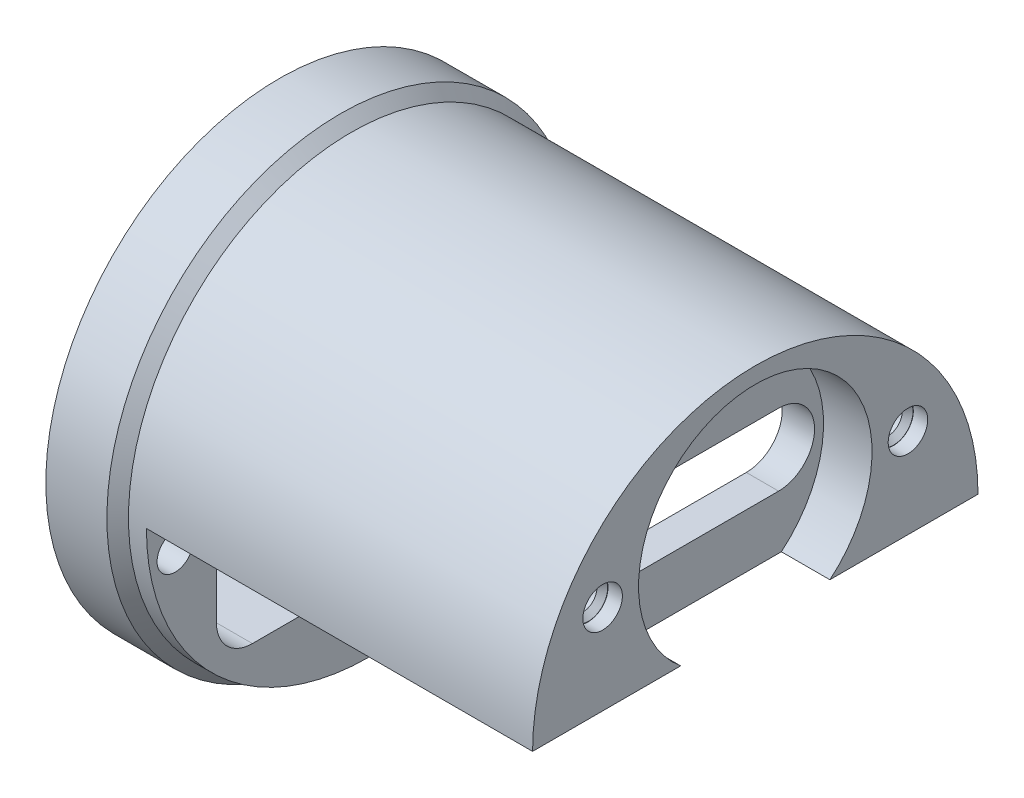
ISO-10303-21;
HEADER;
FILE_DESCRIPTION(('STEP AP214'),'2;1');
FILE_NAME('part.step','',(''),(''),'','','');
FILE_SCHEMA(('AUTOMOTIVE_DESIGN { 1 0 10303 214 1 1 1 1 }'));
ENDSEC;
DATA;
#1=APPLICATION_CONTEXT('core data for automotive mechanical design processes');
#2=APPLICATION_PROTOCOL_DEFINITION('international standard','automotive_design',2000,#1);
#3=PRODUCT_CONTEXT('',#1,'mechanical');
#4=PRODUCT('Part','Part','',(#3));
#5=PRODUCT_RELATED_PRODUCT_CATEGORY('part','',(#4));
#6=PRODUCT_DEFINITION_FORMATION('','',#4);
#7=PRODUCT_DEFINITION_CONTEXT('part definition',#1,'design');
#8=PRODUCT_DEFINITION('design','',#6,#7);
#9=PRODUCT_DEFINITION_SHAPE('','',#8);
#10=(LENGTH_UNIT() NAMED_UNIT(*) SI_UNIT(.MILLI.,.METRE.));
#11=(NAMED_UNIT(*) PLANE_ANGLE_UNIT() SI_UNIT($,.RADIAN.));
#12=(NAMED_UNIT(*) SI_UNIT($,.STERADIAN.) SOLID_ANGLE_UNIT());
#13=UNCERTAINTY_MEASURE_WITH_UNIT(LENGTH_MEASURE(1.E-05),#10,'distance_accuracy_value','');
#14=(GEOMETRIC_REPRESENTATION_CONTEXT(3) GLOBAL_UNCERTAINTY_ASSIGNED_CONTEXT((#13)) GLOBAL_UNIT_ASSIGNED_CONTEXT((#10,
#11,#12)) REPRESENTATION_CONTEXT('',''));
#15=CARTESIAN_POINT('',(0.,0.,0.));
#16=DIRECTION('',(0.,0.,1.));
#17=DIRECTION('',(1.,0.,0.));
#18=AXIS2_PLACEMENT_3D('',#15,#16,#17);
#19=CARTESIAN_POINT('',(-3.57708126390472,5.,8.5));
#20=DIRECTION('',(-1.,0.,0.));
#21=DIRECTION('',(0.,0.,1.));
#22=AXIS2_PLACEMENT_3D('',#19,#20,#21);
#23=PLANE('',#22);
#24=CARTESIAN_POINT('',(-3.57708126387024,5.,8.5));
#25=DIRECTION('',(1.,0.,0.));
#26=DIRECTION('',(0.,0.,-1.));
#27=AXIS2_PLACEMENT_3D('',#24,#25,#26);
#28=CIRCLE('',#27,1.08350000002338);
#29=CARTESIAN_POINT('',(-3.57708126387024,5.,7.41649999997662));
#30=VERTEX_POINT('',#29);
#31=EDGE_CURVE('E263',#30,#30,#28,.T.);
#32=ORIENTED_EDGE('',*,*,#31,.F.);
#33=EDGE_LOOP('',(#32));
#34=FACE_BOUND('',#33,.T.);
#35=CARTESIAN_POINT('',(-3.57708126390472,5.,8.5));
#36=DIRECTION('',(1.,0.,0.));
#37=DIRECTION('',(0.,0.,-1.));
#38=AXIS2_PLACEMENT_3D('',#35,#36,#37);
#39=CIRCLE('',#38,1.1);
#40=CARTESIAN_POINT('',(-3.57708126390472,5.,7.4));
#41=VERTEX_POINT('',#40);
#42=EDGE_CURVE('E257',#41,#41,#39,.T.);
#43=ORIENTED_EDGE('',*,*,#42,.T.);
#44=EDGE_LOOP('',(#43));
#45=FACE_BOUND('',#44,.T.);
#46=ADVANCED_FACE('F16',(#34,#45),#23,.F.);
#47=CARTESIAN_POINT('',(-3.57708126390472,5.,-8.5));
#48=DIRECTION('',(-1.,0.,0.));
#49=DIRECTION('',(0.,0.,1.));
#50=AXIS2_PLACEMENT_3D('',#47,#48,#49);
#51=PLANE('',#50);
#52=CARTESIAN_POINT('',(-3.57708126387024,5.,-8.5));
#53=DIRECTION('',(1.,0.,0.));
#54=DIRECTION('',(0.,1.,0.));
#55=AXIS2_PLACEMENT_3D('',#52,#53,#54);
#56=CIRCLE('',#55,1.08350000001928);
#57=CARTESIAN_POINT('',(-3.57708126387024,6.08350000001928,-8.5));
#58=VERTEX_POINT('',#57);
#59=EDGE_CURVE('E260',#58,#58,#56,.T.);
#60=ORIENTED_EDGE('',*,*,#59,.F.);
#61=EDGE_LOOP('',(#60));
#62=FACE_BOUND('',#61,.T.);
#63=CARTESIAN_POINT('',(-3.57708126390472,5.,-8.5));
#64=DIRECTION('',(1.,0.,0.));
#65=DIRECTION('',(0.,0.,-1.));
#66=AXIS2_PLACEMENT_3D('',#63,#64,#65);
#67=CIRCLE('',#66,1.1);
#68=CARTESIAN_POINT('',(-3.57708126390472,5.,-9.6));
#69=VERTEX_POINT('',#68);
#70=EDGE_CURVE('E180',#69,#69,#67,.T.);
#71=ORIENTED_EDGE('',*,*,#70,.T.);
#72=EDGE_LOOP('',(#71));
#73=FACE_BOUND('',#72,.T.);
#74=ADVANCED_FACE('F567',(#62,#73),#51,.F.);
#75=CARTESIAN_POINT('',(-27.5770812639047,0.,0.));
#76=DIRECTION('',(1.,0.,0.));
#77=DIRECTION('',(0.,0.,-1.));
#78=AXIS2_PLACEMENT_3D('',#75,#76,#77);
#79=CYLINDRICAL_SURFACE('',#78,13.);
#80=CARTESIAN_POINT('',(-25.8770812639047,0.,0.));
#81=DIRECTION('',(-1.,0.,0.));
#82=DIRECTION('',(0.,1.,0.));
#83=AXIS2_PLACEMENT_3D('',#80,#81,#82);
#84=CIRCLE('',#83,13.);
#85=CARTESIAN_POINT('',(-25.8770812639047,13.,0.));
#86=VERTEX_POINT('',#85);
#87=EDGE_CURVE('E177',#86,#86,#84,.F.);
#88=ORIENTED_EDGE('',*,*,#87,.F.);
#89=EDGE_LOOP('',(#88));
#90=FACE_BOUND('',#89,.T.);
#91=CARTESIAN_POINT('',(-29.2770812639047,0.,0.));
#92=DIRECTION('',(1.,0.,0.));
#93=DIRECTION('',(0.,0.,-1.));
#94=AXIS2_PLACEMENT_3D('',#91,#92,#93);
#95=CIRCLE('',#94,13.);
#96=CARTESIAN_POINT('',(-29.2770812639047,0.,-13.));
#97=VERTEX_POINT('',#96);
#98=EDGE_CURVE('E266',#97,#97,#95,.F.);
#99=ORIENTED_EDGE('',*,*,#98,.F.);
#100=EDGE_LOOP('',(#99));
#101=FACE_BOUND('',#100,.T.);
#102=ADVANCED_FACE('F279',(#90,#101),#79,.T.);
#103=CARTESIAN_POINT('',(-29.2770812638992,-1.9,-10.8));
#104=DIRECTION('',(-1.,0.,0.));
#105=DIRECTION('',(0.,0.,1.));
#106=AXIS2_PLACEMENT_3D('',#103,#104,#105);
#107=CONICAL_SURFACE('',#106,1.35000000004156,0.785398163397448);
#108=CARTESIAN_POINT('',(-29.2770812638992,-1.9,-10.8));
#109=DIRECTION('',(-1.,0.,0.));
#110=DIRECTION('',(0.,0.,1.));
#111=AXIS2_PLACEMENT_3D('',#108,#109,#110);
#112=CIRCLE('',#111,1.35000000004156);
#113=CARTESIAN_POINT('',(-29.2770812638992,-1.9,-9.44999999995844));
#114=VERTEX_POINT('',#113);
#115=EDGE_CURVE('E19',#114,#114,#112,.F.);
#116=ORIENTED_EDGE('',*,*,#115,.F.);
#117=EDGE_LOOP('',(#116));
#118=FACE_BOUND('',#117,.T.);
#119=CARTESIAN_POINT('',(-28.9335812639047,-1.9,-10.8));
#120=DIRECTION('',(-1.,0.,0.));
#121=DIRECTION('',(0.,0.,1.));
#122=AXIS2_PLACEMENT_3D('',#119,#120,#121);
#123=CIRCLE('',#122,1.0065);
#124=CARTESIAN_POINT('',(-28.9335812639047,-1.9,-9.7935));
#125=VERTEX_POINT('',#124);
#126=EDGE_CURVE('E174',#125,#125,#123,.F.);
#127=ORIENTED_EDGE('',*,*,#126,.T.);
#128=EDGE_LOOP('',(#127));
#129=FACE_BOUND('',#128,.T.);
#130=ADVANCED_FACE('F275',(#118,#129),#107,.F.);
#131=CARTESIAN_POINT('',(-29.2770812638992,-1.9,10.8));
#132=DIRECTION('',(-1.,0.,0.));
#133=DIRECTION('',(0.,0.,1.));
#134=AXIS2_PLACEMENT_3D('',#131,#132,#133);
#135=CONICAL_SURFACE('',#134,1.35000000007649,0.785398163397448);
#136=CARTESIAN_POINT('',(-29.2770812638992,-1.9,10.8));
#137=DIRECTION('',(-1.,0.,0.));
#138=DIRECTION('',(0.,0.,1.));
#139=AXIS2_PLACEMENT_3D('',#136,#137,#138);
#140=CIRCLE('',#139,1.35000000007649);
#141=CARTESIAN_POINT('',(-29.2770812638992,-1.9,12.1500000000765));
#142=VERTEX_POINT('',#141);
#143=EDGE_CURVE('E268',#142,#142,#140,.F.);
#144=ORIENTED_EDGE('',*,*,#143,.F.);
#145=EDGE_LOOP('',(#144));
#146=FACE_BOUND('',#145,.T.);
#147=CARTESIAN_POINT('',(-28.9335812639047,-1.9,10.8));
#148=DIRECTION('',(-1.,0.,0.));
#149=DIRECTION('',(0.,0.,1.));
#150=AXIS2_PLACEMENT_3D('',#147,#148,#149);
#151=CIRCLE('',#150,1.0065);
#152=CARTESIAN_POINT('',(-28.9335812639047,-1.9,11.8065));
#153=VERTEX_POINT('',#152);
#154=EDGE_CURVE('E154',#153,#153,#151,.F.);
#155=ORIENTED_EDGE('',*,*,#154,.T.);
#156=EDGE_LOOP('',(#155));
#157=FACE_BOUND('',#156,.T.);
#158=ADVANCED_FACE('F278',(#146,#157),#135,.F.);
#159=CARTESIAN_POINT('',(-29.2770812639047,6.5,0.));
#160=DIRECTION('',(-1.,0.,0.));
#161=DIRECTION('',(0.,0.,1.));
#162=AXIS2_PLACEMENT_3D('',#159,#160,#161);
#163=PLANE('',#162);
#164=ORIENTED_EDGE('',*,*,#98,.T.);
#165=EDGE_LOOP('',(#164));
#166=FACE_BOUND('',#165,.T.);
#167=DIRECTION('',(0.,-1.,0.));
#168=VECTOR('',#167,1.);
#169=CARTESIAN_POINT('',(-29.2770812639047,-6.5,8.5));
#170=LINE('',#169,#168);
#171=CARTESIAN_POINT('',(-29.2770812639047,6.5,8.5));
#172=VERTEX_POINT('',#171);
#173=CARTESIAN_POINT('',(-29.2770812639047,-6.5,8.5));
#174=VERTEX_POINT('',#173);
#175=EDGE_CURVE('E417',#172,#174,#170,.T.);
#176=ORIENTED_EDGE('',*,*,#175,.T.);
#177=CARTESIAN_POINT('',(-29.2770812639047,-6.5,6.5));
#178=DIRECTION('',(1.,0.,0.));
#179=DIRECTION('',(0.,0.,-1.));
#180=AXIS2_PLACEMENT_3D('',#177,#178,#179);
#181=CIRCLE('',#180,2.);
#182=CARTESIAN_POINT('',(-29.2770812639047,-8.5,6.5));
#183=VERTEX_POINT('',#182);
#184=EDGE_CURVE('E161',#174,#183,#181,.T.);
#185=ORIENTED_EDGE('',*,*,#184,.T.);
#186=DIRECTION('',(0.,0.,-1.));
#187=VECTOR('',#186,1.);
#188=CARTESIAN_POINT('',(-29.2770812639047,-8.5,-6.5));
#189=LINE('',#188,#187);
#190=CARTESIAN_POINT('',(-29.2770812639047,-8.5,-6.5));
#191=VERTEX_POINT('',#190);
#192=EDGE_CURVE('E153',#183,#191,#189,.T.);
#193=ORIENTED_EDGE('',*,*,#192,.T.);
#194=CARTESIAN_POINT('',(-29.2770812639047,-6.5,-6.5));
#195=DIRECTION('',(1.,0.,0.));
#196=DIRECTION('',(0.,0.,-1.));
#197=AXIS2_PLACEMENT_3D('',#194,#195,#196);
#198=CIRCLE('',#197,2.);
#199=CARTESIAN_POINT('',(-29.2770812639047,-6.5,-8.5));
#200=VERTEX_POINT('',#199);
#201=EDGE_CURVE('E143',#191,#200,#198,.T.);
#202=ORIENTED_EDGE('',*,*,#201,.T.);
#203=DIRECTION('',(0.,1.,0.));
#204=VECTOR('',#203,1.);
#205=CARTESIAN_POINT('',(-29.2770812639047,6.5,-8.5));
#206=LINE('',#205,#204);
#207=CARTESIAN_POINT('',(-29.2770812639047,6.5,-8.5));
#208=VERTEX_POINT('',#207);
#209=EDGE_CURVE('E170',#200,#208,#206,.T.);
#210=ORIENTED_EDGE('',*,*,#209,.T.);
#211=CARTESIAN_POINT('',(-29.2770812639047,6.5,-6.5));
#212=DIRECTION('',(1.,0.,0.));
#213=DIRECTION('',(0.,0.,-1.));
#214=AXIS2_PLACEMENT_3D('',#211,#212,#213);
#215=CIRCLE('',#214,2.);
#216=CARTESIAN_POINT('',(-29.2770812639047,8.5,-6.5));
#217=VERTEX_POINT('',#216);
#218=EDGE_CURVE('E249',#208,#217,#215,.T.);
#219=ORIENTED_EDGE('',*,*,#218,.T.);
#220=DIRECTION('',(0.,0.,1.));
#221=VECTOR('',#220,1.);
#222=CARTESIAN_POINT('',(-29.2770812639047,8.5,6.5));
#223=LINE('',#222,#221);
#224=CARTESIAN_POINT('',(-29.2770812639047,8.5,6.5));
#225=VERTEX_POINT('',#224);
#226=EDGE_CURVE('E423',#217,#225,#223,.T.);
#227=ORIENTED_EDGE('',*,*,#226,.T.);
#228=CARTESIAN_POINT('',(-29.2770812639047,6.5,6.5));
#229=DIRECTION('',(1.,0.,0.));
#230=DIRECTION('',(0.,0.,-1.));
#231=AXIS2_PLACEMENT_3D('',#228,#229,#230);
#232=CIRCLE('',#231,2.);
#233=EDGE_CURVE('E245',#225,#172,#232,.T.);
#234=ORIENTED_EDGE('',*,*,#233,.T.);
#235=EDGE_LOOP('',(#176,#185,#193,#202,#210,#219,#227,#234));
#236=FACE_BOUND('',#235,.T.);
#237=ORIENTED_EDGE('',*,*,#143,.T.);
#238=EDGE_LOOP('',(#237));
#239=FACE_BOUND('',#238,.T.);
#240=ORIENTED_EDGE('',*,*,#115,.T.);
#241=EDGE_LOOP('',(#240));
#242=FACE_BOUND('',#241,.T.);
#243=ADVANCED_FACE('F165',(#166,#236,#239,#242),#163,.T.);
#244=CARTESIAN_POINT('',(-3.87708126396547,5.,8.5));
#245=DIRECTION('',(1.,0.,0.));
#246=DIRECTION('',(0.,0.,-1.));
#247=AXIS2_PLACEMENT_3D('',#244,#245,#246);
#248=CONICAL_SURFACE('',#247,0.783499999928154,0.785398163397448);
#249=CARTESIAN_POINT('',(-3.87708126390472,5.,8.5));
#250=DIRECTION('',(1.,0.,0.));
#251=DIRECTION('',(0.,0.,-1.));
#252=AXIS2_PLACEMENT_3D('',#249,#250,#251);
#253=CIRCLE('',#252,0.7835);
#254=CARTESIAN_POINT('',(-3.87708126390472,5.,7.7165));
#255=VERTEX_POINT('',#254);
#256=EDGE_CURVE('E436',#255,#255,#253,.F.);
#257=ORIENTED_EDGE('',*,*,#256,.T.);
#258=EDGE_LOOP('',(#257));
#259=FACE_BOUND('',#258,.T.);
#260=ORIENTED_EDGE('',*,*,#31,.T.);
#261=EDGE_LOOP('',(#260));
#262=FACE_BOUND('',#261,.T.);
#263=ADVANCED_FACE('F555',(#259,#262),#248,.F.);
#264=CARTESIAN_POINT('',(-3.87708126402231,5.,-8.5));
#265=DIRECTION('',(1.,0.,0.));
#266=DIRECTION('',(0.,1.,0.));
#267=AXIS2_PLACEMENT_3D('',#264,#265,#266);
#268=CONICAL_SURFACE('',#267,0.783499999867217,0.785398163397448);
#269=CARTESIAN_POINT('',(-3.87708126390472,5.,-8.5));
#270=DIRECTION('',(1.,0.,0.));
#271=DIRECTION('',(0.,0.,-1.));
#272=AXIS2_PLACEMENT_3D('',#269,#270,#271);
#273=CIRCLE('',#272,0.7835);
#274=CARTESIAN_POINT('',(-3.87708126390472,5.,-9.2835));
#275=VERTEX_POINT('',#274);
#276=EDGE_CURVE('E413',#275,#275,#273,.F.);
#277=ORIENTED_EDGE('',*,*,#276,.T.);
#278=EDGE_LOOP('',(#277));
#279=FACE_BOUND('',#278,.T.);
#280=ORIENTED_EDGE('',*,*,#59,.T.);
#281=EDGE_LOOP('',(#280));
#282=FACE_BOUND('',#281,.T.);
#283=ADVANCED_FACE('F551',(#279,#282),#268,.F.);
#284=CARTESIAN_POINT('',(-3.17708126390472,5.,8.5));
#285=DIRECTION('',(1.,0.,0.));
#286=DIRECTION('',(0.,0.,-1.));
#287=AXIS2_PLACEMENT_3D('',#284,#285,#286);
#288=CYLINDRICAL_SURFACE('',#287,1.1);
#289=CARTESIAN_POINT('',(-2.77708126390471,5.,8.5));
#290=DIRECTION('',(1.,0.,0.));
#291=DIRECTION('',(0.,0.,-1.));
#292=AXIS2_PLACEMENT_3D('',#289,#290,#291);
#293=CIRCLE('',#292,1.1);
#294=CARTESIAN_POINT('',(-2.77708126390471,5.,7.4));
#295=VERTEX_POINT('',#294);
#296=EDGE_CURVE('E232',#295,#295,#293,.F.);
#297=ORIENTED_EDGE('',*,*,#296,.F.);
#298=EDGE_LOOP('',(#297));
#299=FACE_BOUND('',#298,.T.);
#300=ORIENTED_EDGE('',*,*,#42,.F.);
#301=EDGE_LOOP('',(#300));
#302=FACE_BOUND('',#301,.T.);
#303=ADVANCED_FACE('F547',(#299,#302),#288,.F.);
#304=CARTESIAN_POINT('',(-3.17708126390472,5.,-8.5));
#305=DIRECTION('',(1.,0.,0.));
#306=DIRECTION('',(0.,0.,-1.));
#307=AXIS2_PLACEMENT_3D('',#304,#305,#306);
#308=CYLINDRICAL_SURFACE('',#307,1.1);
#309=CARTESIAN_POINT('',(-2.77708126390471,5.,-8.5));
#310=DIRECTION('',(1.,0.,0.));
#311=DIRECTION('',(0.,0.,-1.));
#312=AXIS2_PLACEMENT_3D('',#309,#310,#311);
#313=CIRCLE('',#312,1.1);
#314=CARTESIAN_POINT('',(-2.77708126390471,5.,-9.6));
#315=VERTEX_POINT('',#314);
#316=EDGE_CURVE('E229',#315,#315,#313,.F.);
#317=ORIENTED_EDGE('',*,*,#316,.F.);
#318=EDGE_LOOP('',(#317));
#319=FACE_BOUND('',#318,.T.);
#320=ORIENTED_EDGE('',*,*,#70,.F.);
#321=EDGE_LOOP('',(#320));
#322=FACE_BOUND('',#321,.T.);
#323=ADVANCED_FACE('F543',(#319,#322),#308,.F.);
#324=CARTESIAN_POINT('',(-25.8770812639047,0.,0.));
#325=DIRECTION('',(-1.,0.,0.));
#326=DIRECTION('',(0.,0.,1.));
#327=AXIS2_PLACEMENT_3D('',#324,#325,#326);
#328=CONICAL_SURFACE('',#327,13.,0.785398163397445);
#329=CARTESIAN_POINT('',(-25.2770812639047,0.,0.));
#330=DIRECTION('',(1.,0.,0.));
#331=DIRECTION('',(0.,0.,-1.));
#332=AXIS2_PLACEMENT_3D('',#329,#330,#331);
#333=CIRCLE('',#332,12.4);
#334=CARTESIAN_POINT('',(-25.2770812639047,0.,-12.4));
#335=VERTEX_POINT('',#334);
#336=EDGE_CURVE('E224',#335,#335,#333,.T.);
#337=ORIENTED_EDGE('',*,*,#336,.F.);
#338=EDGE_LOOP('',(#337));
#339=FACE_BOUND('',#338,.T.);
#340=ORIENTED_EDGE('',*,*,#87,.T.);
#341=EDGE_LOOP('',(#340));
#342=FACE_BOUND('',#341,.T.);
#343=ADVANCED_FACE('F287',(#339,#342),#328,.T.);
#344=CARTESIAN_POINT('',(-20.2770812639047,-1.9,-10.8));
#345=DIRECTION('',(-1.,0.,0.));
#346=DIRECTION('',(0.,0.,1.));
#347=AXIS2_PLACEMENT_3D('',#344,#345,#346);
#348=CYLINDRICAL_SURFACE('',#347,1.0065);
#349=ORIENTED_EDGE('',*,*,#126,.F.);
#350=EDGE_LOOP('',(#349));
#351=FACE_BOUND('',#350,.T.);
#352=CARTESIAN_POINT('',(-24.2770812639047,-1.9,-10.8));
#353=DIRECTION('',(-1.,0.,0.));
#354=DIRECTION('',(0.,0.,1.));
#355=AXIS2_PLACEMENT_3D('',#352,#353,#354);
#356=CIRCLE('',#355,1.0065);
#357=CARTESIAN_POINT('',(-24.2770812639047,-1.9,-9.7935));
#358=VERTEX_POINT('',#357);
#359=EDGE_CURVE('E221',#358,#358,#356,.T.);
#360=ORIENTED_EDGE('',*,*,#359,.F.);
#361=EDGE_LOOP('',(#360));
#362=FACE_BOUND('',#361,.T.);
#363=ADVANCED_FACE('F283',(#351,#362),#348,.F.);
#364=CARTESIAN_POINT('',(-20.2770812639047,-1.9,10.8));
#365=DIRECTION('',(-1.,0.,0.));
#366=DIRECTION('',(0.,0.,1.));
#367=AXIS2_PLACEMENT_3D('',#364,#365,#366);
#368=CYLINDRICAL_SURFACE('',#367,1.0065);
#369=ORIENTED_EDGE('',*,*,#154,.F.);
#370=EDGE_LOOP('',(#369));
#371=FACE_BOUND('',#370,.T.);
#372=CARTESIAN_POINT('',(-24.2770812639047,-1.9,10.8));
#373=DIRECTION('',(-1.,0.,0.));
#374=DIRECTION('',(0.,0.,1.));
#375=AXIS2_PLACEMENT_3D('',#372,#373,#374);
#376=CIRCLE('',#375,1.0065);
#377=CARTESIAN_POINT('',(-24.2770812639047,-1.9,11.8065));
#378=VERTEX_POINT('',#377);
#379=EDGE_CURVE('E218',#378,#378,#376,.T.);
#380=ORIENTED_EDGE('',*,*,#379,.F.);
#381=EDGE_LOOP('',(#380));
#382=FACE_BOUND('',#381,.T.);
#383=ADVANCED_FACE('F286',(#371,#382),#368,.F.);
#384=CARTESIAN_POINT('',(-29.2770812639047,-6.5,-6.5));
#385=DIRECTION('',(1.,0.,0.));
#386=DIRECTION('',(0.,0.,-1.));
#387=AXIS2_PLACEMENT_3D('',#384,#385,#386);
#388=CYLINDRICAL_SURFACE('',#387,2.);
#389=DIRECTION('',(1.,0.,0.));
#390=VECTOR('',#389,1.);
#391=CARTESIAN_POINT('',(-29.2770812639047,-6.5,-8.49999999999999));
#392=LINE('',#391,#390);
#393=CARTESIAN_POINT('',(-24.2770812639047,-6.5,-8.5));
#394=VERTEX_POINT('',#393);
#395=EDGE_CURVE('E149',#394,#200,#392,.F.);
#396=ORIENTED_EDGE('',*,*,#395,.T.);
#397=ORIENTED_EDGE('',*,*,#201,.F.);
#398=DIRECTION('',(1.,0.,0.));
#399=VECTOR('',#398,1.);
#400=CARTESIAN_POINT('',(-29.2770812639047,-8.5,-6.5));
#401=LINE('',#400,#399);
#402=CARTESIAN_POINT('',(-24.2770812639047,-8.5,-6.5));
#403=VERTEX_POINT('',#402);
#404=EDGE_CURVE('E147',#191,#403,#401,.T.);
#405=ORIENTED_EDGE('',*,*,#404,.T.);
#406=CARTESIAN_POINT('',(-24.2770812639047,-6.5,-6.5));
#407=DIRECTION('',(1.,0.,0.));
#408=DIRECTION('',(0.,0.,-1.));
#409=AXIS2_PLACEMENT_3D('',#406,#407,#408);
#410=CIRCLE('',#409,2.);
#411=EDGE_CURVE('E212',#394,#403,#410,.F.);
#412=ORIENTED_EDGE('',*,*,#411,.F.);
#413=EDGE_LOOP('',(#396,#397,#405,#412));
#414=FACE_BOUND('',#413,.T.);
#415=ADVANCED_FACE('F145',(#414),#388,.F.);
#416=CARTESIAN_POINT('',(-29.2770812639047,-8.5,-6.5));
#417=DIRECTION('',(0.,-1.,0.));
#418=DIRECTION('',(0.,0.,-1.));
#419=AXIS2_PLACEMENT_3D('',#416,#417,#418);
#420=PLANE('',#419);
#421=ORIENTED_EDGE('',*,*,#404,.F.);
#422=ORIENTED_EDGE('',*,*,#192,.F.);
#423=DIRECTION('',(1.,0.,0.));
#424=VECTOR('',#423,1.);
#425=CARTESIAN_POINT('',(-29.2770812639047,-8.5,6.5));
#426=LINE('',#425,#424);
#427=CARTESIAN_POINT('',(-24.2770812639047,-8.5,6.5));
#428=VERTEX_POINT('',#427);
#429=EDGE_CURVE('E253',#183,#428,#426,.T.);
#430=ORIENTED_EDGE('',*,*,#429,.T.);
#431=DIRECTION('',(0.,0.,-1.));
#432=VECTOR('',#431,1.);
#433=CARTESIAN_POINT('',(-24.2770812639047,-8.5,0.));
#434=LINE('',#433,#432);
#435=EDGE_CURVE('E160',#403,#428,#434,.F.);
#436=ORIENTED_EDGE('',*,*,#435,.F.);
#437=EDGE_LOOP('',(#421,#422,#430,#436));
#438=FACE_BOUND('',#437,.T.);
#439=ADVANCED_FACE('F157',(#438),#420,.F.);
#440=CARTESIAN_POINT('',(-29.2770812639047,-6.5,6.5));
#441=DIRECTION('',(1.,0.,0.));
#442=DIRECTION('',(0.,0.,-1.));
#443=AXIS2_PLACEMENT_3D('',#440,#441,#442);
#444=CYLINDRICAL_SURFACE('',#443,2.);
#445=ORIENTED_EDGE('',*,*,#429,.F.);
#446=ORIENTED_EDGE('',*,*,#184,.F.);
#447=DIRECTION('',(1.,0.,0.));
#448=VECTOR('',#447,1.);
#449=CARTESIAN_POINT('',(-29.2770812639047,-6.5,8.5));
#450=LINE('',#449,#448);
#451=CARTESIAN_POINT('',(-24.2770812639047,-6.5,8.5));
#452=VERTEX_POINT('',#451);
#453=EDGE_CURVE('E434',#174,#452,#450,.T.);
#454=ORIENTED_EDGE('',*,*,#453,.T.);
#455=CARTESIAN_POINT('',(-24.2770812639047,-6.5,6.5));
#456=DIRECTION('',(1.,0.,0.));
#457=DIRECTION('',(0.,0.,-1.));
#458=AXIS2_PLACEMENT_3D('',#455,#456,#457);
#459=CIRCLE('',#458,2.);
#460=EDGE_CURVE('E209',#428,#452,#459,.F.);
#461=ORIENTED_EDGE('',*,*,#460,.F.);
#462=EDGE_LOOP('',(#445,#446,#454,#461));
#463=FACE_BOUND('',#462,.T.);
#464=ADVANCED_FACE('F530',(#463),#444,.F.);
#465=CARTESIAN_POINT('',(-29.2770812639047,6.5,-8.5));
#466=DIRECTION('',(0.,0.,-1.));
#467=DIRECTION('',(0.,1.,0.));
#468=AXIS2_PLACEMENT_3D('',#465,#466,#467);
#469=PLANE('',#468);
#470=DIRECTION('',(1.,0.,0.));
#471=VECTOR('',#470,1.);
#472=CARTESIAN_POINT('',(-29.2770812639047,0.,-8.5));
#473=LINE('',#472,#471);
#474=CARTESIAN_POINT('',(-23.2770812639047,0.,-8.5));
#475=VERTEX_POINT('',#474);
#476=CARTESIAN_POINT('',(-24.2770812639047,0.,-8.5));
#477=VERTEX_POINT('',#476);
#478=EDGE_CURVE('E428',#475,#477,#473,.F.);
#479=ORIENTED_EDGE('',*,*,#478,.F.);
#480=DIRECTION('',(0.,1.,0.));
#481=VECTOR('',#480,1.);
#482=CARTESIAN_POINT('',(-23.2770812639047,0.,-8.5));
#483=LINE('',#482,#481);
#484=CARTESIAN_POINT('',(-23.2770812639047,6.5,-8.5));
#485=VERTEX_POINT('',#484);
#486=EDGE_CURVE('E208',#475,#485,#483,.T.);
#487=ORIENTED_EDGE('',*,*,#486,.T.);
#488=DIRECTION('',(1.,0.,0.));
#489=VECTOR('',#488,1.);
#490=CARTESIAN_POINT('',(-29.2770812639047,6.5,-8.5));
#491=LINE('',#490,#489);
#492=EDGE_CURVE('E252',#485,#208,#491,.F.);
#493=ORIENTED_EDGE('',*,*,#492,.T.);
#494=ORIENTED_EDGE('',*,*,#209,.F.);
#495=ORIENTED_EDGE('',*,*,#395,.F.);
#496=DIRECTION('',(0.,1.,0.));
#497=VECTOR('',#496,1.);
#498=CARTESIAN_POINT('',(-24.2770812639047,-4.55921800622678,-8.5));
#499=LINE('',#498,#497);
#500=EDGE_CURVE('E214',#477,#394,#499,.F.);
#501=ORIENTED_EDGE('',*,*,#500,.F.);
#502=EDGE_LOOP('',(#479,#487,#493,#494,#495,#501));
#503=FACE_BOUND('',#502,.T.);
#504=ADVANCED_FACE('F460',(#503),#469,.F.);
#505=CARTESIAN_POINT('',(-29.2770812639047,6.5,-6.5));
#506=DIRECTION('',(1.,0.,0.));
#507=DIRECTION('',(0.,0.,-1.));
#508=AXIS2_PLACEMENT_3D('',#505,#506,#507);
#509=CYLINDRICAL_SURFACE('',#508,2.);
#510=DIRECTION('',(1.,0.,0.));
#511=VECTOR('',#510,1.);
#512=CARTESIAN_POINT('',(-29.2770812639047,8.5,-6.5));
#513=LINE('',#512,#511);
#514=CARTESIAN_POINT('',(-23.2770812639047,8.5,-6.5));
#515=VERTEX_POINT('',#514);
#516=EDGE_CURVE('E251',#515,#217,#513,.F.);
#517=ORIENTED_EDGE('',*,*,#516,.T.);
#518=ORIENTED_EDGE('',*,*,#218,.F.);
#519=ORIENTED_EDGE('',*,*,#492,.F.);
#520=CARTESIAN_POINT('',(-23.2770812639047,6.5,-6.5));
#521=DIRECTION('',(1.,0.,0.));
#522=DIRECTION('',(0.,0.,-1.));
#523=AXIS2_PLACEMENT_3D('',#520,#521,#522);
#524=CIRCLE('',#523,2.);
#525=EDGE_CURVE('E205',#485,#515,#524,.T.);
#526=ORIENTED_EDGE('',*,*,#525,.T.);
#527=EDGE_LOOP('',(#517,#518,#519,#526));
#528=FACE_BOUND('',#527,.T.);
#529=ADVANCED_FACE('F457',(#528),#509,.F.);
#530=CARTESIAN_POINT('',(-29.2770812639047,8.5,6.5));
#531=DIRECTION('',(0.,1.,0.));
#532=DIRECTION('',(0.,0.,1.));
#533=AXIS2_PLACEMENT_3D('',#530,#531,#532);
#534=PLANE('',#533);
#535=DIRECTION('',(1.,0.,0.));
#536=VECTOR('',#535,1.);
#537=CARTESIAN_POINT('',(-29.2770812639047,8.5,6.5));
#538=LINE('',#537,#536);
#539=CARTESIAN_POINT('',(-23.2770812639047,8.5,6.5));
#540=VERTEX_POINT('',#539);
#541=EDGE_CURVE('E248',#540,#225,#538,.F.);
#542=ORIENTED_EDGE('',*,*,#541,.T.);
#543=ORIENTED_EDGE('',*,*,#226,.F.);
#544=ORIENTED_EDGE('',*,*,#516,.F.);
#545=DIRECTION('',(0.,0.,1.));
#546=VECTOR('',#545,1.);
#547=CARTESIAN_POINT('',(-23.2770812639047,8.5,0.));
#548=LINE('',#547,#546);
#549=EDGE_CURVE('E204',#515,#540,#548,.T.);
#550=ORIENTED_EDGE('',*,*,#549,.T.);
#551=EDGE_LOOP('',(#542,#543,#544,#550));
#552=FACE_BOUND('',#551,.T.);
#553=ADVANCED_FACE('F451',(#552),#534,.F.);
#554=CARTESIAN_POINT('',(-29.2770812639047,6.5,6.5));
#555=DIRECTION('',(1.,0.,0.));
#556=DIRECTION('',(0.,0.,-1.));
#557=AXIS2_PLACEMENT_3D('',#554,#555,#556);
#558=CYLINDRICAL_SURFACE('',#557,2.);
#559=DIRECTION('',(1.,0.,0.));
#560=VECTOR('',#559,1.);
#561=CARTESIAN_POINT('',(-29.2770812639047,6.5,8.5));
#562=LINE('',#561,#560);
#563=CARTESIAN_POINT('',(-23.2770812639047,6.5,8.5));
#564=VERTEX_POINT('',#563);
#565=EDGE_CURVE('E414',#564,#172,#562,.F.);
#566=ORIENTED_EDGE('',*,*,#565,.T.);
#567=ORIENTED_EDGE('',*,*,#233,.F.);
#568=ORIENTED_EDGE('',*,*,#541,.F.);
#569=CARTESIAN_POINT('',(-23.2770812639047,6.5,6.5));
#570=DIRECTION('',(1.,0.,0.));
#571=DIRECTION('',(0.,0.,-1.));
#572=AXIS2_PLACEMENT_3D('',#569,#570,#571);
#573=CIRCLE('',#572,2.);
#574=EDGE_CURVE('E201',#540,#564,#573,.T.);
#575=ORIENTED_EDGE('',*,*,#574,.T.);
#576=EDGE_LOOP('',(#566,#567,#568,#575));
#577=FACE_BOUND('',#576,.T.);
#578=ADVANCED_FACE('F449',(#577),#558,.F.);
#579=CARTESIAN_POINT('',(-29.2770812639047,-6.5,8.5));
#580=DIRECTION('',(0.,0.,1.));
#581=DIRECTION('',(0.,-1.,0.));
#582=AXIS2_PLACEMENT_3D('',#579,#580,#581);
#583=PLANE('',#582);
#584=ORIENTED_EDGE('',*,*,#453,.F.);
#585=ORIENTED_EDGE('',*,*,#175,.F.);
#586=ORIENTED_EDGE('',*,*,#565,.F.);
#587=DIRECTION('',(0.,1.,0.));
#588=VECTOR('',#587,1.);
#589=CARTESIAN_POINT('',(-23.2770812639047,0.,8.5));
#590=LINE('',#589,#588);
#591=CARTESIAN_POINT('',(-23.2770812639047,0.,8.5));
#592=VERTEX_POINT('',#591);
#593=EDGE_CURVE('E200',#564,#592,#590,.F.);
#594=ORIENTED_EDGE('',*,*,#593,.T.);
#595=DIRECTION('',(1.,0.,0.));
#596=VECTOR('',#595,1.);
#597=CARTESIAN_POINT('',(-29.2770812639047,0.,8.5));
#598=LINE('',#597,#596);
#599=CARTESIAN_POINT('',(-24.2770812639047,0.,8.5));
#600=VERTEX_POINT('',#599);
#601=EDGE_CURVE('E247',#600,#592,#598,.T.);
#602=ORIENTED_EDGE('',*,*,#601,.F.);
#603=DIRECTION('',(0.,1.,0.));
#604=VECTOR('',#603,1.);
#605=CARTESIAN_POINT('',(-24.2770812639047,-4.55921800622678,8.5));
#606=LINE('',#605,#604);
#607=EDGE_CURVE('E217',#452,#600,#606,.T.);
#608=ORIENTED_EDGE('',*,*,#607,.F.);
#609=EDGE_LOOP('',(#584,#585,#586,#594,#602,#608));
#610=FACE_BOUND('',#609,.T.);
#611=ADVANCED_FACE('F517',(#610),#583,.F.);
#612=CARTESIAN_POINT('',(-6.77708126390471,5.,8.5));
#613=DIRECTION('',(1.,0.,0.));
#614=DIRECTION('',(0.,0.,-1.));
#615=AXIS2_PLACEMENT_3D('',#612,#613,#614);
#616=CYLINDRICAL_SURFACE('',#615,0.7835);
#617=CARTESIAN_POINT('',(-7.27708126390472,5.,8.5));
#618=DIRECTION('',(1.,0.,0.));
#619=DIRECTION('',(0.,0.,-1.));
#620=AXIS2_PLACEMENT_3D('',#617,#618,#619);
#621=CIRCLE('',#620,0.7835);
#622=CARTESIAN_POINT('',(-7.27708126390472,5.,7.7165));
#623=VERTEX_POINT('',#622);
#624=EDGE_CURVE('E197',#623,#623,#621,.T.);
#625=ORIENTED_EDGE('',*,*,#624,.F.);
#626=EDGE_LOOP('',(#625));
#627=FACE_BOUND('',#626,.T.);
#628=ORIENTED_EDGE('',*,*,#256,.F.);
#629=EDGE_LOOP('',(#628));
#630=FACE_BOUND('',#629,.T.);
#631=ADVANCED_FACE('F513',(#627,#630),#616,.F.);
#632=CARTESIAN_POINT('',(-6.77708126390471,5.,-8.5));
#633=DIRECTION('',(1.,0.,0.));
#634=DIRECTION('',(0.,0.,-1.));
#635=AXIS2_PLACEMENT_3D('',#632,#633,#634);
#636=CYLINDRICAL_SURFACE('',#635,0.7835);
#637=CARTESIAN_POINT('',(-7.27708126390472,5.,-8.5));
#638=DIRECTION('',(1.,0.,0.));
#639=DIRECTION('',(0.,0.,-1.));
#640=AXIS2_PLACEMENT_3D('',#637,#638,#639);
#641=CIRCLE('',#640,0.7835);
#642=CARTESIAN_POINT('',(-7.27708126390472,5.,-9.2835));
#643=VERTEX_POINT('',#642);
#644=EDGE_CURVE('E194',#643,#643,#641,.T.);
#645=ORIENTED_EDGE('',*,*,#644,.F.);
#646=EDGE_LOOP('',(#645));
#647=FACE_BOUND('',#646,.T.);
#648=ORIENTED_EDGE('',*,*,#276,.F.);
#649=EDGE_LOOP('',(#648));
#650=FACE_BOUND('',#649,.T.);
#651=ADVANCED_FACE('F510',(#647,#650),#636,.F.);
#652=CARTESIAN_POINT('',(-5.47708126390472,5.,4.));
#653=DIRECTION('',(-1.,0.,0.));
#654=DIRECTION('',(0.,0.,1.));
#655=AXIS2_PLACEMENT_3D('',#652,#653,#654);
#656=CYLINDRICAL_SURFACE('',#655,2.);
#657=DIRECTION('',(1.,0.,0.));
#658=VECTOR('',#657,1.);
#659=CARTESIAN_POINT('',(-5.47708126390472,7.,4.));
#660=LINE('',#659,#658);
#661=CARTESIAN_POINT('',(-7.27708126390472,7.,4.));
#662=VERTEX_POINT('',#661);
#663=CARTESIAN_POINT('',(-5.47708126390472,7.,4.));
#664=VERTEX_POINT('',#663);
#665=EDGE_CURVE('E405',#662,#664,#660,.T.);
#666=ORIENTED_EDGE('',*,*,#665,.T.);
#667=CARTESIAN_POINT('',(-5.47708126390472,5.,4.));
#668=DIRECTION('',(-1.,0.,0.));
#669=DIRECTION('',(0.,0.,1.));
#670=AXIS2_PLACEMENT_3D('',#667,#668,#669);
#671=CIRCLE('',#670,2.);
#672=CARTESIAN_POINT('',(-5.47708126390472,3.,4.));
#673=VERTEX_POINT('',#672);
#674=EDGE_CURVE('E237',#664,#673,#671,.F.);
#675=ORIENTED_EDGE('',*,*,#674,.T.);
#676=DIRECTION('',(1.,0.,0.));
#677=VECTOR('',#676,1.);
#678=CARTESIAN_POINT('',(-5.47708126390472,3.,4.));
#679=LINE('',#678,#677);
#680=CARTESIAN_POINT('',(-7.27708126390472,3.,4.));
#681=VERTEX_POINT('',#680);
#682=EDGE_CURVE('E410',#673,#681,#679,.F.);
#683=ORIENTED_EDGE('',*,*,#682,.T.);
#684=CARTESIAN_POINT('',(-7.27708126390472,5.,4.));
#685=DIRECTION('',(-1.,0.,0.));
#686=DIRECTION('',(0.,0.,1.));
#687=AXIS2_PLACEMENT_3D('',#684,#685,#686);
#688=CIRCLE('',#687,2.);
#689=EDGE_CURVE('E192',#662,#681,#688,.F.);
#690=ORIENTED_EDGE('',*,*,#689,.F.);
#691=EDGE_LOOP('',(#666,#675,#683,#690));
#692=FACE_BOUND('',#691,.T.);
#693=ADVANCED_FACE('F496',(#692),#656,.F.);
#694=CARTESIAN_POINT('',(-5.47708126390472,3.,4.));
#695=DIRECTION('',(0.,-1.,0.));
#696=DIRECTION('',(0.,0.,-1.));
#697=AXIS2_PLACEMENT_3D('',#694,#695,#696);
#698=PLANE('',#697);
#699=ORIENTED_EDGE('',*,*,#682,.F.);
#700=DIRECTION('',(0.,0.,1.));
#701=VECTOR('',#700,1.);
#702=CARTESIAN_POINT('',(-5.47708126390472,3.,0.));
#703=LINE('',#702,#701);
#704=CARTESIAN_POINT('',(-5.47708126390472,3.,-4.));
#705=VERTEX_POINT('',#704);
#706=EDGE_CURVE('E244',#673,#705,#703,.F.);
#707=ORIENTED_EDGE('',*,*,#706,.T.);
#708=DIRECTION('',(-1.,0.,0.));
#709=VECTOR('',#708,1.);
#710=CARTESIAN_POINT('',(-5.47708126390472,3.,-4.));
#711=LINE('',#710,#709);
#712=CARTESIAN_POINT('',(-7.27708126390472,3.,-4.));
#713=VERTEX_POINT('',#712);
#714=EDGE_CURVE('E407',#705,#713,#711,.T.);
#715=ORIENTED_EDGE('',*,*,#714,.T.);
#716=DIRECTION('',(0.,0.,1.));
#717=VECTOR('',#716,1.);
#718=CARTESIAN_POINT('',(-7.27708126390472,3.,0.));
#719=LINE('',#718,#717);
#720=EDGE_CURVE('E191',#681,#713,#719,.F.);
#721=ORIENTED_EDGE('',*,*,#720,.F.);
#722=EDGE_LOOP('',(#699,#707,#715,#721));
#723=FACE_BOUND('',#722,.T.);
#724=ADVANCED_FACE('F494',(#723),#698,.F.);
#725=CARTESIAN_POINT('',(-5.47708126390472,5.,-4.));
#726=DIRECTION('',(-1.,0.,0.));
#727=DIRECTION('',(0.,0.,1.));
#728=AXIS2_PLACEMENT_3D('',#725,#726,#727);
#729=CYLINDRICAL_SURFACE('',#728,2.);
#730=ORIENTED_EDGE('',*,*,#714,.F.);
#731=CARTESIAN_POINT('',(-5.47708126390472,5.,-4.));
#732=DIRECTION('',(-1.,0.,0.));
#733=DIRECTION('',(0.,0.,1.));
#734=AXIS2_PLACEMENT_3D('',#731,#732,#733);
#735=CIRCLE('',#734,2.);
#736=CARTESIAN_POINT('',(-5.47708126390472,7.,-4.));
#737=VERTEX_POINT('',#736);
#738=EDGE_CURVE('E241',#705,#737,#735,.F.);
#739=ORIENTED_EDGE('',*,*,#738,.T.);
#740=DIRECTION('',(1.,0.,0.));
#741=VECTOR('',#740,1.);
#742=CARTESIAN_POINT('',(-5.47708126390472,7.,-4.));
#743=LINE('',#742,#741);
#744=CARTESIAN_POINT('',(-7.27708126390472,7.,-4.));
#745=VERTEX_POINT('',#744);
#746=EDGE_CURVE('E391',#737,#745,#743,.F.);
#747=ORIENTED_EDGE('',*,*,#746,.T.);
#748=CARTESIAN_POINT('',(-7.27708126390472,5.,-4.));
#749=DIRECTION('',(-1.,0.,0.));
#750=DIRECTION('',(0.,0.,1.));
#751=AXIS2_PLACEMENT_3D('',#748,#749,#750);
#752=CIRCLE('',#751,2.);
#753=EDGE_CURVE('E188',#713,#745,#752,.F.);
#754=ORIENTED_EDGE('',*,*,#753,.F.);
#755=EDGE_LOOP('',(#730,#739,#747,#754));
#756=FACE_BOUND('',#755,.T.);
#757=ADVANCED_FACE('F490',(#756),#729,.F.);
#758=CARTESIAN_POINT('',(-5.47708126390472,7.,-4.));
#759=DIRECTION('',(0.,1.,0.));
#760=DIRECTION('',(0.,0.,1.));
#761=AXIS2_PLACEMENT_3D('',#758,#759,#760);
#762=PLANE('',#761);
#763=ORIENTED_EDGE('',*,*,#746,.F.);
#764=DIRECTION('',(0.,0.,1.));
#765=VECTOR('',#764,1.);
#766=CARTESIAN_POINT('',(-5.47708126390472,7.,0.));
#767=LINE('',#766,#765);
#768=EDGE_CURVE('E240',#737,#664,#767,.T.);
#769=ORIENTED_EDGE('',*,*,#768,.T.);
#770=ORIENTED_EDGE('',*,*,#665,.F.);
#771=DIRECTION('',(0.,0.,1.));
#772=VECTOR('',#771,1.);
#773=CARTESIAN_POINT('',(-7.27708126390472,7.,0.));
#774=LINE('',#773,#772);
#775=EDGE_CURVE('E190',#745,#662,#774,.T.);
#776=ORIENTED_EDGE('',*,*,#775,.F.);
#777=EDGE_LOOP('',(#763,#769,#770,#776));
#778=FACE_BOUND('',#777,.T.);
#779=ADVANCED_FACE('F482',(#778),#762,.F.);
#780=CARTESIAN_POINT('',(-5.47708126390472,5.,0.));
#781=DIRECTION('',(-1.,0.,0.));
#782=DIRECTION('',(0.,0.,1.));
#783=AXIS2_PLACEMENT_3D('',#780,#781,#782);
#784=PLANE('',#783);
#785=CARTESIAN_POINT('',(-5.47708126390472,5.,0.));
#786=DIRECTION('',(-1.,0.,0.));
#787=DIRECTION('',(0.,0.,1.));
#788=AXIS2_PLACEMENT_3D('',#785,#786,#787);
#789=CIRCLE('',#788,6.5);
#790=CARTESIAN_POINT('',(-5.47708126390472,0.,-4.15331193145903));
#791=VERTEX_POINT('',#790);
#792=CARTESIAN_POINT('',(-5.47708126390472,0.,4.15331193145903));
#793=VERTEX_POINT('',#792);
#794=EDGE_CURVE('E235',#791,#793,#789,.F.);
#795=ORIENTED_EDGE('',*,*,#794,.T.);
#796=DIRECTION('',(0.,0.,1.));
#797=VECTOR('',#796,1.);
#798=CARTESIAN_POINT('',(-5.47708126390472,0.,-13.));
#799=LINE('',#798,#797);
#800=EDGE_CURVE('E383',#793,#791,#799,.F.);
#801=ORIENTED_EDGE('',*,*,#800,.T.);
#802=EDGE_LOOP('',(#795,#801));
#803=FACE_BOUND('',#802,.T.);
#804=ORIENTED_EDGE('',*,*,#768,.F.);
#805=ORIENTED_EDGE('',*,*,#738,.F.);
#806=ORIENTED_EDGE('',*,*,#706,.F.);
#807=ORIENTED_EDGE('',*,*,#674,.F.);
#808=EDGE_LOOP('',(#804,#805,#806,#807));
#809=FACE_BOUND('',#808,.T.);
#810=ADVANCED_FACE('F479',(#803,#809),#784,.F.);
#811=CARTESIAN_POINT('',(-2.77708126390471,5.,0.));
#812=DIRECTION('',(-1.,0.,0.));
#813=DIRECTION('',(0.,0.,1.));
#814=AXIS2_PLACEMENT_3D('',#811,#812,#813);
#815=CYLINDRICAL_SURFACE('',#814,6.5);
#816=ORIENTED_EDGE('',*,*,#794,.F.);
#817=DIRECTION('',(1.,0.,0.));
#818=VECTOR('',#817,1.);
#819=CARTESIAN_POINT('',(-2.77708126390471,0.,-4.15331193145903));
#820=LINE('',#819,#818);
#821=CARTESIAN_POINT('',(-2.77708126390471,0.,-4.15331193145903));
#822=VERTEX_POINT('',#821);
#823=EDGE_CURVE('E380',#791,#822,#820,.T.);
#824=ORIENTED_EDGE('',*,*,#823,.T.);
#825=CARTESIAN_POINT('',(-2.77708126390471,5.,0.));
#826=DIRECTION('',(-1.,0.,0.));
#827=DIRECTION('',(0.,0.,1.));
#828=AXIS2_PLACEMENT_3D('',#825,#826,#827);
#829=CIRCLE('',#828,6.5);
#830=CARTESIAN_POINT('',(-2.77708126390471,0.,4.15331193145903));
#831=VERTEX_POINT('',#830);
#832=EDGE_CURVE('E227',#831,#822,#829,.T.);
#833=ORIENTED_EDGE('',*,*,#832,.F.);
#834=DIRECTION('',(1.,0.,0.));
#835=VECTOR('',#834,1.);
#836=CARTESIAN_POINT('',(-2.77708126390471,0.,4.15331193145903));
#837=LINE('',#836,#835);
#838=EDGE_CURVE('E386',#831,#793,#837,.F.);
#839=ORIENTED_EDGE('',*,*,#838,.T.);
#840=EDGE_LOOP('',(#816,#824,#833,#839));
#841=FACE_BOUND('',#840,.T.);
#842=ADVANCED_FACE('F477',(#841),#815,.F.);
#843=CARTESIAN_POINT('',(-2.77708126390471,6.2,0.));
#844=DIRECTION('',(1.,0.,0.));
#845=DIRECTION('',(0.,0.,-1.));
#846=AXIS2_PLACEMENT_3D('',#843,#844,#845);
#847=PLANE('',#846);
#848=CARTESIAN_POINT('',(-2.77708126390471,0.,0.));
#849=DIRECTION('',(1.,0.,0.));
#850=DIRECTION('',(0.,0.,-1.));
#851=AXIS2_PLACEMENT_3D('',#848,#849,#850);
#852=CIRCLE('',#851,12.4);
#853=CARTESIAN_POINT('',(-2.77708126390471,0.,12.4));
#854=VERTEX_POINT('',#853);
#855=CARTESIAN_POINT('',(-2.77708126390471,0.,-12.4));
#856=VERTEX_POINT('',#855);
#857=EDGE_CURVE('E225',#854,#856,#852,.F.);
#858=ORIENTED_EDGE('',*,*,#857,.F.);
#859=DIRECTION('',(0.,0.,1.));
#860=VECTOR('',#859,1.);
#861=CARTESIAN_POINT('',(-2.77708126390471,0.,-13.));
#862=LINE('',#861,#860);
#863=EDGE_CURVE('E394',#854,#831,#862,.F.);
#864=ORIENTED_EDGE('',*,*,#863,.T.);
#865=ORIENTED_EDGE('',*,*,#832,.T.);
#866=DIRECTION('',(0.,0.,1.));
#867=VECTOR('',#866,1.);
#868=CARTESIAN_POINT('',(-2.77708126390471,0.,-13.));
#869=LINE('',#868,#867);
#870=EDGE_CURVE('E373',#822,#856,#869,.F.);
#871=ORIENTED_EDGE('',*,*,#870,.T.);
#872=EDGE_LOOP('',(#858,#864,#865,#871));
#873=FACE_BOUND('',#872,.T.);
#874=ORIENTED_EDGE('',*,*,#316,.T.);
#875=EDGE_LOOP('',(#874));
#876=FACE_BOUND('',#875,.T.);
#877=ORIENTED_EDGE('',*,*,#296,.T.);
#878=EDGE_LOOP('',(#877));
#879=FACE_BOUND('',#878,.T.);
#880=ADVANCED_FACE('F305',(#873,#876,#879),#847,.T.);
#881=CARTESIAN_POINT('',(-14.0270812639047,0.,0.));
#882=DIRECTION('',(1.,0.,0.));
#883=DIRECTION('',(0.,0.,-1.));
#884=AXIS2_PLACEMENT_3D('',#881,#882,#883);
#885=CYLINDRICAL_SURFACE('',#884,12.4);
#886=DIRECTION('',(1.,0.,0.));
#887=VECTOR('',#886,1.);
#888=CARTESIAN_POINT('',(-2.77708126390471,0.,12.4));
#889=LINE('',#888,#887);
#890=CARTESIAN_POINT('',(-24.2770812639047,0.,12.4));
#891=VERTEX_POINT('',#890);
#892=EDGE_CURVE('E397',#891,#854,#889,.T.);
#893=ORIENTED_EDGE('',*,*,#892,.T.);
#894=ORIENTED_EDGE('',*,*,#857,.T.);
#895=DIRECTION('',(1.,0.,0.));
#896=VECTOR('',#895,1.);
#897=CARTESIAN_POINT('',(-2.77708126390471,0.,-12.4));
#898=LINE('',#897,#896);
#899=CARTESIAN_POINT('',(-24.2770812639047,0.,-12.4));
#900=VERTEX_POINT('',#899);
#901=EDGE_CURVE('E370',#856,#900,#898,.F.);
#902=ORIENTED_EDGE('',*,*,#901,.T.);
#903=CARTESIAN_POINT('',(-24.2770812639047,0.,0.));
#904=DIRECTION('',(1.,0.,0.));
#905=DIRECTION('',(0.,0.,-1.));
#906=AXIS2_PLACEMENT_3D('',#903,#904,#905);
#907=CIRCLE('',#906,12.4);
#908=EDGE_CURVE('E215',#891,#900,#907,.T.);
#909=ORIENTED_EDGE('',*,*,#908,.F.);
#910=EDGE_LOOP('',(#893,#894,#902,#909));
#911=FACE_BOUND('',#910,.T.);
#912=ORIENTED_EDGE('',*,*,#336,.T.);
#913=EDGE_LOOP('',(#912));
#914=FACE_BOUND('',#913,.T.);
#915=ADVANCED_FACE('F294',(#911,#914),#885,.T.);
#916=CARTESIAN_POINT('',(-24.2770812639047,-4.55921800622678,0.));
#917=DIRECTION('',(1.,0.,0.));
#918=DIRECTION('',(0.,0.,-1.));
#919=AXIS2_PLACEMENT_3D('',#916,#917,#918);
#920=PLANE('',#919);
#921=ORIENTED_EDGE('',*,*,#435,.T.);
#922=ORIENTED_EDGE('',*,*,#460,.T.);
#923=ORIENTED_EDGE('',*,*,#607,.T.);
#924=DIRECTION('',(0.,0.,1.));
#925=VECTOR('',#924,1.);
#926=CARTESIAN_POINT('',(-24.2770812639047,0.,-13.));
#927=LINE('',#926,#925);
#928=EDGE_CURVE('E343',#600,#891,#927,.T.);
#929=ORIENTED_EDGE('',*,*,#928,.T.);
#930=ORIENTED_EDGE('',*,*,#908,.T.);
#931=DIRECTION('',(0.,0.,1.));
#932=VECTOR('',#931,1.);
#933=CARTESIAN_POINT('',(-24.2770812639047,0.,-13.));
#934=LINE('',#933,#932);
#935=EDGE_CURVE('E358',#900,#477,#934,.T.);
#936=ORIENTED_EDGE('',*,*,#935,.T.);
#937=ORIENTED_EDGE('',*,*,#500,.T.);
#938=ORIENTED_EDGE('',*,*,#411,.T.);
#939=EDGE_LOOP('',(#921,#922,#923,#929,#930,#936,#937,#938));
#940=FACE_BOUND('',#939,.T.);
#941=ORIENTED_EDGE('',*,*,#379,.T.);
#942=EDGE_LOOP('',(#941));
#943=FACE_BOUND('',#942,.T.);
#944=ORIENTED_EDGE('',*,*,#359,.T.);
#945=EDGE_LOOP('',(#944));
#946=FACE_BOUND('',#945,.T.);
#947=ADVANCED_FACE('F291',(#940,#943,#946),#920,.T.);
#948=CARTESIAN_POINT('',(-23.2770812639047,0.,0.));
#949=DIRECTION('',(-1.,0.,0.));
#950=DIRECTION('',(0.,0.,1.));
#951=AXIS2_PLACEMENT_3D('',#948,#949,#950);
#952=PLANE('',#951);
#953=CARTESIAN_POINT('',(-23.2770812639047,0.,0.));
#954=DIRECTION('',(-1.,0.,0.));
#955=DIRECTION('',(0.,0.,1.));
#956=AXIS2_PLACEMENT_3D('',#953,#954,#955);
#957=CIRCLE('',#956,11.25);
#958=CARTESIAN_POINT('',(-23.2770812639047,0.,-11.25));
#959=VERTEX_POINT('',#958);
#960=CARTESIAN_POINT('',(-23.2770812639047,0.,11.25));
#961=VERTEX_POINT('',#960);
#962=EDGE_CURVE('E184',#959,#961,#957,.F.);
#963=ORIENTED_EDGE('',*,*,#962,.T.);
#964=DIRECTION('',(0.,0.,1.));
#965=VECTOR('',#964,1.);
#966=CARTESIAN_POINT('',(-23.2770812639047,0.,-13.));
#967=LINE('',#966,#965);
#968=EDGE_CURVE('E332',#961,#592,#967,.F.);
#969=ORIENTED_EDGE('',*,*,#968,.T.);
#970=ORIENTED_EDGE('',*,*,#593,.F.);
#971=ORIENTED_EDGE('',*,*,#574,.F.);
#972=ORIENTED_EDGE('',*,*,#549,.F.);
#973=ORIENTED_EDGE('',*,*,#525,.F.);
#974=ORIENTED_EDGE('',*,*,#486,.F.);
#975=DIRECTION('',(0.,0.,1.));
#976=VECTOR('',#975,1.);
#977=CARTESIAN_POINT('',(-23.2770812639047,0.,-13.));
#978=LINE('',#977,#976);
#979=EDGE_CURVE('E187',#475,#959,#978,.F.);
#980=ORIENTED_EDGE('',*,*,#979,.T.);
#981=EDGE_LOOP('',(#963,#969,#970,#971,#972,#973,#974,#980));
#982=FACE_BOUND('',#981,.T.);
#983=ADVANCED_FACE('F293',(#982),#952,.F.);
#984=CARTESIAN_POINT('',(-7.27708126390472,0.,0.));
#985=DIRECTION('',(-1.,0.,0.));
#986=DIRECTION('',(0.,0.,1.));
#987=AXIS2_PLACEMENT_3D('',#984,#985,#986);
#988=PLANE('',#987);
#989=ORIENTED_EDGE('',*,*,#753,.T.);
#990=ORIENTED_EDGE('',*,*,#775,.T.);
#991=ORIENTED_EDGE('',*,*,#689,.T.);
#992=ORIENTED_EDGE('',*,*,#720,.T.);
#993=EDGE_LOOP('',(#989,#990,#991,#992));
#994=FACE_BOUND('',#993,.T.);
#995=ORIENTED_EDGE('',*,*,#644,.T.);
#996=EDGE_LOOP('',(#995));
#997=FACE_BOUND('',#996,.T.);
#998=ORIENTED_EDGE('',*,*,#624,.T.);
#999=EDGE_LOOP('',(#998));
#1000=FACE_BOUND('',#999,.T.);
#1001=DIRECTION('',(0.,0.,1.));
#1002=VECTOR('',#1001,1.);
#1003=CARTESIAN_POINT('',(-7.27708126390472,0.,-13.));
#1004=LINE('',#1003,#1002);
#1005=CARTESIAN_POINT('',(-7.27708126390472,0.,-11.25));
#1006=VERTEX_POINT('',#1005);
#1007=CARTESIAN_POINT('',(-7.27708126390472,0.,11.25));
#1008=VERTEX_POINT('',#1007);
#1009=EDGE_CURVE('E33',#1006,#1008,#1004,.T.);
#1010=ORIENTED_EDGE('',*,*,#1009,.T.);
#1011=CARTESIAN_POINT('',(-7.27708126390472,0.,0.));
#1012=DIRECTION('',(-1.,0.,0.));
#1013=DIRECTION('',(0.,0.,1.));
#1014=AXIS2_PLACEMENT_3D('',#1011,#1012,#1013);
#1015=CIRCLE('',#1014,11.25);
#1016=EDGE_CURVE('E25',#1008,#1006,#1015,.T.);
#1017=ORIENTED_EDGE('',*,*,#1016,.T.);
#1018=EDGE_LOOP('',(#1010,#1017));
#1019=FACE_BOUND('',#1018,.T.);
#1020=ADVANCED_FACE('F302',(#994,#997,#1000,#1019),#988,.T.);
#1021=CARTESIAN_POINT('',(-2.77708126390471,0.,-13.));
#1022=DIRECTION('',(0.,1.,0.));
#1023=DIRECTION('',(0.,0.,1.));
#1024=AXIS2_PLACEMENT_3D('',#1021,#1022,#1023);
#1025=PLANE('',#1024);
#1026=ORIENTED_EDGE('',*,*,#478,.T.);
#1027=ORIENTED_EDGE('',*,*,#935,.F.);
#1028=ORIENTED_EDGE('',*,*,#901,.F.);
#1029=ORIENTED_EDGE('',*,*,#870,.F.);
#1030=ORIENTED_EDGE('',*,*,#823,.F.);
#1031=ORIENTED_EDGE('',*,*,#800,.F.);
#1032=ORIENTED_EDGE('',*,*,#838,.F.);
#1033=ORIENTED_EDGE('',*,*,#863,.F.);
#1034=ORIENTED_EDGE('',*,*,#892,.F.);
#1035=ORIENTED_EDGE('',*,*,#928,.F.);
#1036=ORIENTED_EDGE('',*,*,#601,.T.);
#1037=ORIENTED_EDGE('',*,*,#968,.F.);
#1038=DIRECTION('',(-1.,0.,0.));
#1039=VECTOR('',#1038,1.);
#1040=CARTESIAN_POINT('',(-7.27708126390472,0.,11.25));
#1041=LINE('',#1040,#1039);
#1042=EDGE_CURVE('E183',#961,#1008,#1041,.F.);
#1043=ORIENTED_EDGE('',*,*,#1042,.T.);
#1044=ORIENTED_EDGE('',*,*,#1009,.F.);
#1045=DIRECTION('',(-1.,0.,0.));
#1046=VECTOR('',#1045,1.);
#1047=CARTESIAN_POINT('',(-7.27708126390472,0.,-11.25));
#1048=LINE('',#1047,#1046);
#1049=EDGE_CURVE('E10',#1006,#959,#1048,.T.);
#1050=ORIENTED_EDGE('',*,*,#1049,.T.);
#1051=ORIENTED_EDGE('',*,*,#979,.F.);
#1052=EDGE_LOOP('',(#1026,#1027,#1028,#1029,#1030,#1031,#1032,#1033,#1034,#1035,#1036,#1037,
#1043,#1044,#1050,#1051));
#1053=FACE_BOUND('',#1052,.T.);
#1054=ADVANCED_FACE('F311',(#1053),#1025,.F.);
#1055=CARTESIAN_POINT('',(-7.27708126390472,0.,0.));
#1056=DIRECTION('',(-1.,0.,0.));
#1057=DIRECTION('',(0.,0.,1.));
#1058=AXIS2_PLACEMENT_3D('',#1055,#1056,#1057);
#1059=CYLINDRICAL_SURFACE('',#1058,11.25);
#1060=ORIENTED_EDGE('',*,*,#1016,.F.);
#1061=ORIENTED_EDGE('',*,*,#1042,.F.);
#1062=ORIENTED_EDGE('',*,*,#962,.F.);
#1063=ORIENTED_EDGE('',*,*,#1049,.F.);
#1064=EDGE_LOOP('',(#1060,#1061,#1062,#1063));
#1065=FACE_BOUND('',#1064,.T.);
#1066=ADVANCED_FACE('F309',(#1065),#1059,.F.);
#1067=CLOSED_SHELL('',(#46,#74,#102,#130,#158,#243,#263,#283,#303,#323,#343,#363,#383,#415,#439,
#464,#504,#529,#553,#578,#611,#631,#651,#693,#724,#757,#779,#810,#842,#880,#915,#947,#983,#1020,
#1054,#1066));
#1068=MANIFOLD_SOLID_BREP('B1',#1067);
#1069=ADVANCED_BREP_SHAPE_REPRESENTATION('',(#18,#1068),#14);
#1070=SHAPE_DEFINITION_REPRESENTATION(#9,#1069);
ENDSEC;
END-ISO-10303-21;
